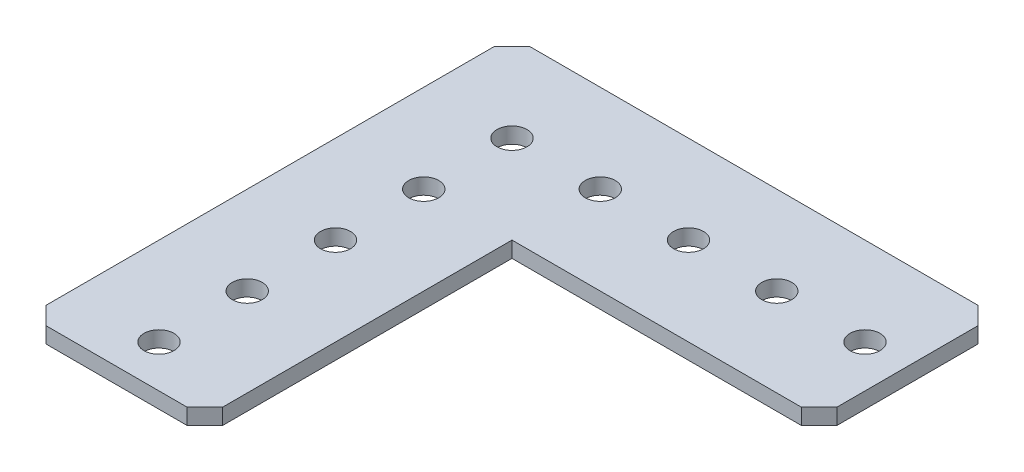
ISO-10303-21;
HEADER;
FILE_DESCRIPTION(('STEP AP214'),'2;1');
FILE_NAME('part.step','',(''),(''),'','','');
FILE_SCHEMA(('AUTOMOTIVE_DESIGN { 1 0 10303 214 1 1 1 1 }'));
ENDSEC;
DATA;
#1=APPLICATION_CONTEXT('core data for automotive mechanical design processes');
#2=APPLICATION_PROTOCOL_DEFINITION('international standard','automotive_design',2000,#1);
#3=PRODUCT_CONTEXT('',#1,'mechanical');
#4=PRODUCT('Part','Part','',(#3));
#5=PRODUCT_RELATED_PRODUCT_CATEGORY('part','',(#4));
#6=PRODUCT_DEFINITION_FORMATION('','',#4);
#7=PRODUCT_DEFINITION_CONTEXT('part definition',#1,'design');
#8=PRODUCT_DEFINITION('design','',#6,#7);
#9=PRODUCT_DEFINITION_SHAPE('','',#8);
#10=(LENGTH_UNIT() NAMED_UNIT(*) SI_UNIT(.MILLI.,.METRE.));
#11=(NAMED_UNIT(*) PLANE_ANGLE_UNIT() SI_UNIT($,.RADIAN.));
#12=(NAMED_UNIT(*) SI_UNIT($,.STERADIAN.) SOLID_ANGLE_UNIT());
#13=UNCERTAINTY_MEASURE_WITH_UNIT(LENGTH_MEASURE(1.E-05),#10,'distance_accuracy_value','');
#14=(GEOMETRIC_REPRESENTATION_CONTEXT(3) GLOBAL_UNCERTAINTY_ASSIGNED_CONTEXT((#13)) GLOBAL_UNIT_ASSIGNED_CONTEXT((#10,
#11,#12)) REPRESENTATION_CONTEXT('',''));
#15=CARTESIAN_POINT('',(0.,0.,0.));
#16=DIRECTION('',(0.,0.,1.));
#17=DIRECTION('',(1.,0.,0.));
#18=AXIS2_PLACEMENT_3D('',#15,#16,#17);
#19=CARTESIAN_POINT('',(0.,2.286,0.));
#20=DIRECTION('',(0.,-1.,0.));
#21=DIRECTION('',(0.,0.,-1.));
#22=AXIS2_PLACEMENT_3D('',#19,#20,#21);
#23=PLANE('',#22);
#24=DIRECTION('',(0.,0.,-1.));
#25=VECTOR('',#24,1.);
#26=CARTESIAN_POINT('',(25.4,2.286,-44.196));
#27=LINE('',#26,#25);
#28=CARTESIAN_POINT('',(25.4,2.286,-2.54));
#29=VERTEX_POINT('',#28);
#30=CARTESIAN_POINT('',(25.4,2.286,-44.196));
#31=VERTEX_POINT('',#30);
#32=EDGE_CURVE('E172',#29,#31,#27,.T.);
#33=ORIENTED_EDGE('',*,*,#32,.T.);
#34=DIRECTION('',(1.,0.,0.));
#35=VECTOR('',#34,1.);
#36=CARTESIAN_POINT('',(67.056,2.286,-44.196));
#37=LINE('',#36,#35);
#38=CARTESIAN_POINT('',(67.056,2.286,-44.196));
#39=VERTEX_POINT('',#38);
#40=EDGE_CURVE('E105',#31,#39,#37,.T.);
#41=ORIENTED_EDGE('',*,*,#40,.T.);
#42=DIRECTION('',(0.707106781186548,0.,-0.707106781186548));
#43=VECTOR('',#42,1.);
#44=CARTESIAN_POINT('',(69.596,2.286,-46.736));
#45=LINE('',#44,#43);
#46=CARTESIAN_POINT('',(69.596,2.286,-46.736));
#47=VERTEX_POINT('',#46);
#48=EDGE_CURVE('E196',#39,#47,#45,.T.);
#49=ORIENTED_EDGE('',*,*,#48,.T.);
#50=DIRECTION('',(0.,0.,-1.));
#51=VECTOR('',#50,1.);
#52=CARTESIAN_POINT('',(69.596,2.286,-67.056));
#53=LINE('',#52,#51);
#54=CARTESIAN_POINT('',(69.596,2.286,-67.056));
#55=VERTEX_POINT('',#54);
#56=EDGE_CURVE('E215',#47,#55,#53,.T.);
#57=ORIENTED_EDGE('',*,*,#56,.T.);
#58=DIRECTION('',(-0.707106781186548,0.,-0.707106781186548));
#59=VECTOR('',#58,1.);
#60=CARTESIAN_POINT('',(67.056,2.286,-69.596));
#61=LINE('',#60,#59);
#62=CARTESIAN_POINT('',(67.056,2.286,-69.596));
#63=VERTEX_POINT('',#62);
#64=EDGE_CURVE('E212',#55,#63,#61,.T.);
#65=ORIENTED_EDGE('',*,*,#64,.T.);
#66=DIRECTION('',(-1.,0.,0.));
#67=VECTOR('',#66,1.);
#68=CARTESIAN_POINT('',(2.54,2.286,-69.596));
#69=LINE('',#68,#67);
#70=CARTESIAN_POINT('',(2.54,2.286,-69.596));
#71=VERTEX_POINT('',#70);
#72=EDGE_CURVE('E214',#63,#71,#69,.T.);
#73=ORIENTED_EDGE('',*,*,#72,.T.);
#74=DIRECTION('',(-0.707106781186547,0.,0.707106781186548));
#75=VECTOR('',#74,1.);
#76=CARTESIAN_POINT('',(0.,2.286,-67.056));
#77=LINE('',#76,#75);
#78=CARTESIAN_POINT('',(0.,2.286,-67.056));
#79=VERTEX_POINT('',#78);
#80=EDGE_CURVE('E217',#71,#79,#77,.T.);
#81=ORIENTED_EDGE('',*,*,#80,.T.);
#82=DIRECTION('',(0.,0.,1.));
#83=VECTOR('',#82,1.);
#84=CARTESIAN_POINT('',(0.,2.286,-2.54));
#85=LINE('',#84,#83);
#86=CARTESIAN_POINT('',(0.,2.286,-2.54));
#87=VERTEX_POINT('',#86);
#88=EDGE_CURVE('E133',#79,#87,#85,.T.);
#89=ORIENTED_EDGE('',*,*,#88,.T.);
#90=DIRECTION('',(0.707106781186548,0.,0.707106781186548));
#91=VECTOR('',#90,1.);
#92=CARTESIAN_POINT('',(2.54,2.286,0.));
#93=LINE('',#92,#91);
#94=CARTESIAN_POINT('',(2.54,2.286,0.));
#95=VERTEX_POINT('',#94);
#96=EDGE_CURVE('E127',#87,#95,#93,.T.);
#97=ORIENTED_EDGE('',*,*,#96,.T.);
#98=DIRECTION('',(1.,0.,0.));
#99=VECTOR('',#98,1.);
#100=CARTESIAN_POINT('',(22.86,2.286,0.));
#101=LINE('',#100,#99);
#102=CARTESIAN_POINT('',(22.86,2.286,0.));
#103=VERTEX_POINT('',#102);
#104=EDGE_CURVE('E131',#95,#103,#101,.T.);
#105=ORIENTED_EDGE('',*,*,#104,.T.);
#106=DIRECTION('',(0.707106781186548,0.,-0.707106781186547));
#107=VECTOR('',#106,1.);
#108=CARTESIAN_POINT('',(25.4,2.286,-2.54));
#109=LINE('',#108,#107);
#110=EDGE_CURVE('E53',#103,#29,#109,.T.);
#111=ORIENTED_EDGE('',*,*,#110,.T.);
#112=EDGE_LOOP('',(#33,#41,#49,#57,#65,#73,#81,#89,#97,#105,#111));
#113=FACE_BOUND('',#112,.T.);
#114=CARTESIAN_POINT('',(12.7,2.286,-56.896));
#115=DIRECTION('',(0.,1.,0.));
#116=DIRECTION('',(0.,0.,1.));
#117=AXIS2_PLACEMENT_3D('',#114,#115,#116);
#118=CIRCLE('',#117,2.159);
#119=CARTESIAN_POINT('',(12.7,2.286,-54.737));
#120=VERTEX_POINT('',#119);
#121=EDGE_CURVE('E155',#120,#120,#118,.T.);
#122=ORIENTED_EDGE('',*,*,#121,.F.);
#123=EDGE_LOOP('',(#122));
#124=FACE_BOUND('',#123,.T.);
#125=CARTESIAN_POINT('',(25.4,2.286,-56.896));
#126=DIRECTION('',(0.,1.,0.));
#127=DIRECTION('',(0.,0.,1.));
#128=AXIS2_PLACEMENT_3D('',#125,#126,#127);
#129=CIRCLE('',#128,2.159);
#130=CARTESIAN_POINT('',(25.4,2.286,-54.737));
#131=VERTEX_POINT('',#130);
#132=EDGE_CURVE('E334',#131,#131,#129,.T.);
#133=ORIENTED_EDGE('',*,*,#132,.F.);
#134=EDGE_LOOP('',(#133));
#135=FACE_BOUND('',#134,.T.);
#136=CARTESIAN_POINT('',(38.1,2.286,-56.896));
#137=DIRECTION('',(0.,1.,0.));
#138=DIRECTION('',(0.,0.,1.));
#139=AXIS2_PLACEMENT_3D('',#136,#137,#138);
#140=CIRCLE('',#139,2.15900000000001);
#141=CARTESIAN_POINT('',(38.1,2.286,-54.737));
#142=VERTEX_POINT('',#141);
#143=EDGE_CURVE('E328',#142,#142,#140,.T.);
#144=ORIENTED_EDGE('',*,*,#143,.F.);
#145=EDGE_LOOP('',(#144));
#146=FACE_BOUND('',#145,.T.);
#147=CARTESIAN_POINT('',(50.8,2.286,-56.896));
#148=DIRECTION('',(0.,1.,0.));
#149=DIRECTION('',(0.,0.,1.));
#150=AXIS2_PLACEMENT_3D('',#147,#148,#149);
#151=CIRCLE('',#150,2.15899999999999);
#152=CARTESIAN_POINT('',(50.8,2.286,-54.737));
#153=VERTEX_POINT('',#152);
#154=EDGE_CURVE('E322',#153,#153,#151,.T.);
#155=ORIENTED_EDGE('',*,*,#154,.F.);
#156=EDGE_LOOP('',(#155));
#157=FACE_BOUND('',#156,.T.);
#158=CARTESIAN_POINT('',(63.5,2.286,-56.896));
#159=DIRECTION('',(0.,1.,0.));
#160=DIRECTION('',(0.,0.,1.));
#161=AXIS2_PLACEMENT_3D('',#158,#159,#160);
#162=CIRCLE('',#161,2.15899999999999);
#163=CARTESIAN_POINT('',(63.5,2.286,-54.737));
#164=VERTEX_POINT('',#163);
#165=EDGE_CURVE('E316',#164,#164,#162,.T.);
#166=ORIENTED_EDGE('',*,*,#165,.F.);
#167=EDGE_LOOP('',(#166));
#168=FACE_BOUND('',#167,.T.);
#169=CARTESIAN_POINT('',(12.7000000000001,2.286,-44.196));
#170=DIRECTION('',(0.,1.,0.));
#171=DIRECTION('',(0.,0.,1.));
#172=AXIS2_PLACEMENT_3D('',#169,#170,#171);
#173=CIRCLE('',#172,2.159);
#174=CARTESIAN_POINT('',(12.7000000000001,2.286,-42.037));
#175=VERTEX_POINT('',#174);
#176=EDGE_CURVE('E310',#175,#175,#173,.T.);
#177=ORIENTED_EDGE('',*,*,#176,.F.);
#178=EDGE_LOOP('',(#177));
#179=FACE_BOUND('',#178,.T.);
#180=CARTESIAN_POINT('',(12.7000000000003,2.286,-31.496));
#181=DIRECTION('',(0.,1.,0.));
#182=DIRECTION('',(0.,0.,1.));
#183=AXIS2_PLACEMENT_3D('',#180,#181,#182);
#184=CIRCLE('',#183,2.159);
#185=CARTESIAN_POINT('',(12.7000000000003,2.286,-29.337));
#186=VERTEX_POINT('',#185);
#187=EDGE_CURVE('E304',#186,#186,#184,.T.);
#188=ORIENTED_EDGE('',*,*,#187,.F.);
#189=EDGE_LOOP('',(#188));
#190=FACE_BOUND('',#189,.T.);
#191=CARTESIAN_POINT('',(12.7000000000004,2.286,-18.796));
#192=DIRECTION('',(0.,1.,0.));
#193=DIRECTION('',(0.,0.,1.));
#194=AXIS2_PLACEMENT_3D('',#191,#192,#193);
#195=CIRCLE('',#194,2.159);
#196=CARTESIAN_POINT('',(12.7000000000004,2.286,-16.637));
#197=VERTEX_POINT('',#196);
#198=EDGE_CURVE('E298',#197,#197,#195,.T.);
#199=ORIENTED_EDGE('',*,*,#198,.F.);
#200=EDGE_LOOP('',(#199));
#201=FACE_BOUND('',#200,.T.);
#202=CARTESIAN_POINT('',(12.7000000000005,2.286,-6.096));
#203=DIRECTION('',(0.,1.,0.));
#204=DIRECTION('',(0.,0.,1.));
#205=AXIS2_PLACEMENT_3D('',#202,#203,#204);
#206=CIRCLE('',#205,2.159);
#207=CARTESIAN_POINT('',(12.7000000000005,2.286,-3.937));
#208=VERTEX_POINT('',#207);
#209=EDGE_CURVE('E289',#208,#208,#206,.T.);
#210=ORIENTED_EDGE('',*,*,#209,.F.);
#211=EDGE_LOOP('',(#210));
#212=FACE_BOUND('',#211,.T.);
#213=ADVANCED_FACE('F36',(#113,#124,#135,#146,#157,#168,#179,#190,#201,#212),#23,.F.);
#214=CARTESIAN_POINT('',(0.,0.,0.));
#215=DIRECTION('',(0.,-1.,0.));
#216=DIRECTION('',(0.,0.,-1.));
#217=AXIS2_PLACEMENT_3D('',#214,#215,#216);
#218=PLANE('',#217);
#219=CARTESIAN_POINT('',(12.7000000000004,0.,-18.796));
#220=DIRECTION('',(0.,1.,0.));
#221=DIRECTION('',(0.,0.,1.));
#222=AXIS2_PLACEMENT_3D('',#219,#220,#221);
#223=CIRCLE('',#222,2.159);
#224=CARTESIAN_POINT('',(12.7000000000004,0.,-16.637));
#225=VERTEX_POINT('',#224);
#226=EDGE_CURVE('E295',#225,#225,#223,.T.);
#227=ORIENTED_EDGE('',*,*,#226,.T.);
#228=EDGE_LOOP('',(#227));
#229=FACE_BOUND('',#228,.T.);
#230=CARTESIAN_POINT('',(12.7000000000001,0.,-44.196));
#231=DIRECTION('',(0.,1.,0.));
#232=DIRECTION('',(0.,0.,1.));
#233=AXIS2_PLACEMENT_3D('',#230,#231,#232);
#234=CIRCLE('',#233,2.159);
#235=CARTESIAN_POINT('',(12.7000000000001,0.,-42.037));
#236=VERTEX_POINT('',#235);
#237=EDGE_CURVE('E307',#236,#236,#234,.T.);
#238=ORIENTED_EDGE('',*,*,#237,.T.);
#239=EDGE_LOOP('',(#238));
#240=FACE_BOUND('',#239,.T.);
#241=CARTESIAN_POINT('',(50.8,0.,-56.896));
#242=DIRECTION('',(0.,1.,0.));
#243=DIRECTION('',(0.,0.,1.));
#244=AXIS2_PLACEMENT_3D('',#241,#242,#243);
#245=CIRCLE('',#244,2.15899999999999);
#246=CARTESIAN_POINT('',(50.8,0.,-54.737));
#247=VERTEX_POINT('',#246);
#248=EDGE_CURVE('E319',#247,#247,#245,.T.);
#249=ORIENTED_EDGE('',*,*,#248,.T.);
#250=EDGE_LOOP('',(#249));
#251=FACE_BOUND('',#250,.T.);
#252=CARTESIAN_POINT('',(25.4,0.,-56.896));
#253=DIRECTION('',(0.,1.,0.));
#254=DIRECTION('',(0.,0.,1.));
#255=AXIS2_PLACEMENT_3D('',#252,#253,#254);
#256=CIRCLE('',#255,2.159);
#257=CARTESIAN_POINT('',(25.4,0.,-54.737));
#258=VERTEX_POINT('',#257);
#259=EDGE_CURVE('E331',#258,#258,#256,.T.);
#260=ORIENTED_EDGE('',*,*,#259,.T.);
#261=EDGE_LOOP('',(#260));
#262=FACE_BOUND('',#261,.T.);
#263=DIRECTION('',(0.,0.,-1.));
#264=VECTOR('',#263,1.);
#265=CARTESIAN_POINT('',(25.4,0.,-44.196));
#266=LINE('',#265,#264);
#267=CARTESIAN_POINT('',(25.4,0.,-2.54));
#268=VERTEX_POINT('',#267);
#269=CARTESIAN_POINT('',(25.4,0.,-44.196));
#270=VERTEX_POINT('',#269);
#271=EDGE_CURVE('E151',#268,#270,#266,.T.);
#272=ORIENTED_EDGE('',*,*,#271,.F.);
#273=DIRECTION('',(0.707106781186548,0.,-0.707106781186547));
#274=VECTOR('',#273,1.);
#275=CARTESIAN_POINT('',(25.4,0.,-2.54));
#276=LINE('',#275,#274);
#277=CARTESIAN_POINT('',(22.86,0.,0.));
#278=VERTEX_POINT('',#277);
#279=EDGE_CURVE('E97',#278,#268,#276,.T.);
#280=ORIENTED_EDGE('',*,*,#279,.F.);
#281=DIRECTION('',(1.,0.,0.));
#282=VECTOR('',#281,1.);
#283=CARTESIAN_POINT('',(22.86,0.,0.));
#284=LINE('',#283,#282);
#285=CARTESIAN_POINT('',(2.54,0.,0.));
#286=VERTEX_POINT('',#285);
#287=EDGE_CURVE('E91',#286,#278,#284,.T.);
#288=ORIENTED_EDGE('',*,*,#287,.F.);
#289=DIRECTION('',(0.707106781186548,0.,0.707106781186548));
#290=VECTOR('',#289,1.);
#291=CARTESIAN_POINT('',(2.54,0.,0.));
#292=LINE('',#291,#290);
#293=CARTESIAN_POINT('',(0.,0.,-2.54));
#294=VERTEX_POINT('',#293);
#295=EDGE_CURVE('E141',#294,#286,#292,.T.);
#296=ORIENTED_EDGE('',*,*,#295,.F.);
#297=DIRECTION('',(0.,0.,1.));
#298=VECTOR('',#297,1.);
#299=CARTESIAN_POINT('',(0.,0.,-2.54));
#300=LINE('',#299,#298);
#301=CARTESIAN_POINT('',(0.,0.,-67.056));
#302=VERTEX_POINT('',#301);
#303=EDGE_CURVE('E167',#302,#294,#300,.T.);
#304=ORIENTED_EDGE('',*,*,#303,.F.);
#305=DIRECTION('',(-0.707106781186547,0.,0.707106781186548));
#306=VECTOR('',#305,1.);
#307=CARTESIAN_POINT('',(0.,0.,-67.056));
#308=LINE('',#307,#306);
#309=CARTESIAN_POINT('',(2.54,0.,-69.596));
#310=VERTEX_POINT('',#309);
#311=EDGE_CURVE('E165',#310,#302,#308,.T.);
#312=ORIENTED_EDGE('',*,*,#311,.F.);
#313=DIRECTION('',(-1.,0.,0.));
#314=VECTOR('',#313,1.);
#315=CARTESIAN_POINT('',(2.54,0.,-69.596));
#316=LINE('',#315,#314);
#317=CARTESIAN_POINT('',(67.056,0.,-69.596));
#318=VERTEX_POINT('',#317);
#319=EDGE_CURVE('E163',#318,#310,#316,.T.);
#320=ORIENTED_EDGE('',*,*,#319,.F.);
#321=DIRECTION('',(-0.707106781186548,0.,-0.707106781186548));
#322=VECTOR('',#321,1.);
#323=CARTESIAN_POINT('',(67.056,0.,-69.596));
#324=LINE('',#323,#322);
#325=CARTESIAN_POINT('',(69.596,0.,-67.056));
#326=VERTEX_POINT('',#325);
#327=EDGE_CURVE('E161',#326,#318,#324,.T.);
#328=ORIENTED_EDGE('',*,*,#327,.F.);
#329=DIRECTION('',(0.,0.,-1.));
#330=VECTOR('',#329,1.);
#331=CARTESIAN_POINT('',(69.596,0.,-67.056));
#332=LINE('',#331,#330);
#333=CARTESIAN_POINT('',(69.596,0.,-46.736));
#334=VERTEX_POINT('',#333);
#335=EDGE_CURVE('E159',#334,#326,#332,.T.);
#336=ORIENTED_EDGE('',*,*,#335,.F.);
#337=DIRECTION('',(0.707106781186548,0.,-0.707106781186548));
#338=VECTOR('',#337,1.);
#339=CARTESIAN_POINT('',(69.596,0.,-46.736));
#340=LINE('',#339,#338);
#341=CARTESIAN_POINT('',(67.056,0.,-44.196));
#342=VERTEX_POINT('',#341);
#343=EDGE_CURVE('E157',#342,#334,#340,.T.);
#344=ORIENTED_EDGE('',*,*,#343,.F.);
#345=DIRECTION('',(1.,0.,0.));
#346=VECTOR('',#345,1.);
#347=CARTESIAN_POINT('',(67.056,0.,-44.196));
#348=LINE('',#347,#346);
#349=EDGE_CURVE('E154',#270,#342,#348,.T.);
#350=ORIENTED_EDGE('',*,*,#349,.F.);
#351=EDGE_LOOP('',(#272,#280,#288,#296,#304,#312,#320,#328,#336,#344,#350));
#352=FACE_BOUND('',#351,.T.);
#353=CARTESIAN_POINT('',(12.7,0.,-56.896));
#354=DIRECTION('',(0.,1.,0.));
#355=DIRECTION('',(0.,0.,1.));
#356=AXIS2_PLACEMENT_3D('',#353,#354,#355);
#357=CIRCLE('',#356,2.159);
#358=CARTESIAN_POINT('',(12.7,0.,-54.737));
#359=VERTEX_POINT('',#358);
#360=EDGE_CURVE('E337',#359,#359,#357,.T.);
#361=ORIENTED_EDGE('',*,*,#360,.T.);
#362=EDGE_LOOP('',(#361));
#363=FACE_BOUND('',#362,.T.);
#364=CARTESIAN_POINT('',(38.1,0.,-56.896));
#365=DIRECTION('',(0.,1.,0.));
#366=DIRECTION('',(0.,0.,1.));
#367=AXIS2_PLACEMENT_3D('',#364,#365,#366);
#368=CIRCLE('',#367,2.15900000000001);
#369=CARTESIAN_POINT('',(38.1,0.,-54.737));
#370=VERTEX_POINT('',#369);
#371=EDGE_CURVE('E325',#370,#370,#368,.T.);
#372=ORIENTED_EDGE('',*,*,#371,.T.);
#373=EDGE_LOOP('',(#372));
#374=FACE_BOUND('',#373,.T.);
#375=CARTESIAN_POINT('',(63.5,0.,-56.896));
#376=DIRECTION('',(0.,1.,0.));
#377=DIRECTION('',(0.,0.,1.));
#378=AXIS2_PLACEMENT_3D('',#375,#376,#377);
#379=CIRCLE('',#378,2.15899999999999);
#380=CARTESIAN_POINT('',(63.5,0.,-54.737));
#381=VERTEX_POINT('',#380);
#382=EDGE_CURVE('E313',#381,#381,#379,.T.);
#383=ORIENTED_EDGE('',*,*,#382,.T.);
#384=EDGE_LOOP('',(#383));
#385=FACE_BOUND('',#384,.T.);
#386=CARTESIAN_POINT('',(12.7000000000003,0.,-31.496));
#387=DIRECTION('',(0.,1.,0.));
#388=DIRECTION('',(0.,0.,1.));
#389=AXIS2_PLACEMENT_3D('',#386,#387,#388);
#390=CIRCLE('',#389,2.159);
#391=CARTESIAN_POINT('',(12.7000000000003,0.,-29.337));
#392=VERTEX_POINT('',#391);
#393=EDGE_CURVE('E301',#392,#392,#390,.T.);
#394=ORIENTED_EDGE('',*,*,#393,.T.);
#395=EDGE_LOOP('',(#394));
#396=FACE_BOUND('',#395,.T.);
#397=CARTESIAN_POINT('',(12.7000000000005,0.,-6.096));
#398=DIRECTION('',(0.,1.,0.));
#399=DIRECTION('',(0.,0.,1.));
#400=AXIS2_PLACEMENT_3D('',#397,#398,#399);
#401=CIRCLE('',#400,2.159);
#402=CARTESIAN_POINT('',(12.7000000000005,0.,-3.937));
#403=VERTEX_POINT('',#402);
#404=EDGE_CURVE('E292',#403,#403,#401,.T.);
#405=ORIENTED_EDGE('',*,*,#404,.T.);
#406=EDGE_LOOP('',(#405));
#407=FACE_BOUND('',#406,.T.);
#408=ADVANCED_FACE('F200',(#229,#240,#251,#262,#352,#363,#374,#385,#396,#407),#218,.T.);
#409=CARTESIAN_POINT('',(25.4,2.286,-44.196));
#410=DIRECTION('',(-1.,0.,0.));
#411=DIRECTION('',(0.,0.,1.));
#412=AXIS2_PLACEMENT_3D('',#409,#410,#411);
#413=PLANE('',#412);
#414=ORIENTED_EDGE('',*,*,#271,.T.);
#415=DIRECTION('',(0.,-1.,0.));
#416=VECTOR('',#415,1.);
#417=CARTESIAN_POINT('',(25.4,2.286,-44.196));
#418=LINE('',#417,#416);
#419=EDGE_CURVE('E11',#31,#270,#418,.T.);
#420=ORIENTED_EDGE('',*,*,#419,.F.);
#421=ORIENTED_EDGE('',*,*,#32,.F.);
#422=DIRECTION('',(0.,-1.,0.));
#423=VECTOR('',#422,1.);
#424=CARTESIAN_POINT('',(25.4,2.286,-2.54));
#425=LINE('',#424,#423);
#426=EDGE_CURVE('E147',#29,#268,#425,.T.);
#427=ORIENTED_EDGE('',*,*,#426,.T.);
#428=EDGE_LOOP('',(#414,#420,#421,#427));
#429=FACE_BOUND('',#428,.T.);
#430=ADVANCED_FACE('F38',(#429),#413,.F.);
#431=CARTESIAN_POINT('',(67.056,2.286,-44.196));
#432=DIRECTION('',(0.,0.,-1.));
#433=DIRECTION('',(-1.,0.,0.));
#434=AXIS2_PLACEMENT_3D('',#431,#432,#433);
#435=PLANE('',#434);
#436=ORIENTED_EDGE('',*,*,#349,.T.);
#437=DIRECTION('',(0.,-1.,0.));
#438=VECTOR('',#437,1.);
#439=CARTESIAN_POINT('',(67.056,2.286,-44.196));
#440=LINE('',#439,#438);
#441=EDGE_CURVE('E45',#39,#342,#440,.T.);
#442=ORIENTED_EDGE('',*,*,#441,.F.);
#443=ORIENTED_EDGE('',*,*,#40,.F.);
#444=ORIENTED_EDGE('',*,*,#419,.T.);
#445=EDGE_LOOP('',(#436,#442,#443,#444));
#446=FACE_BOUND('',#445,.T.);
#447=ADVANCED_FACE('F484',(#446),#435,.F.);
#448=CARTESIAN_POINT('',(69.596,2.286,-46.736));
#449=DIRECTION('',(-0.707106781186548,0.,-0.707106781186548));
#450=DIRECTION('',(-0.707106781186548,0.,0.707106781186548));
#451=AXIS2_PLACEMENT_3D('',#448,#449,#450);
#452=PLANE('',#451);
#453=ORIENTED_EDGE('',*,*,#343,.T.);
#454=DIRECTION('',(0.,-1.,0.));
#455=VECTOR('',#454,1.);
#456=CARTESIAN_POINT('',(69.596,2.286,-46.736));
#457=LINE('',#456,#455);
#458=EDGE_CURVE('E188',#47,#334,#457,.T.);
#459=ORIENTED_EDGE('',*,*,#458,.F.);
#460=ORIENTED_EDGE('',*,*,#48,.F.);
#461=ORIENTED_EDGE('',*,*,#441,.T.);
#462=EDGE_LOOP('',(#453,#459,#460,#461));
#463=FACE_BOUND('',#462,.T.);
#464=ADVANCED_FACE('F194',(#463),#452,.F.);
#465=CARTESIAN_POINT('',(69.596,2.286,-67.056));
#466=DIRECTION('',(-1.,0.,0.));
#467=DIRECTION('',(0.,0.,1.));
#468=AXIS2_PLACEMENT_3D('',#465,#466,#467);
#469=PLANE('',#468);
#470=ORIENTED_EDGE('',*,*,#335,.T.);
#471=DIRECTION('',(0.,-1.,0.));
#472=VECTOR('',#471,1.);
#473=CARTESIAN_POINT('',(69.596,2.286,-67.056));
#474=LINE('',#473,#472);
#475=EDGE_CURVE('E185',#55,#326,#474,.T.);
#476=ORIENTED_EDGE('',*,*,#475,.F.);
#477=ORIENTED_EDGE('',*,*,#56,.F.);
#478=ORIENTED_EDGE('',*,*,#458,.T.);
#479=EDGE_LOOP('',(#470,#476,#477,#478));
#480=FACE_BOUND('',#479,.T.);
#481=ADVANCED_FACE('F206',(#480),#469,.F.);
#482=CARTESIAN_POINT('',(67.056,2.286,-69.596));
#483=DIRECTION('',(-0.707106781186548,0.,0.707106781186548));
#484=DIRECTION('',(0.707106781186548,0.,0.707106781186548));
#485=AXIS2_PLACEMENT_3D('',#482,#483,#484);
#486=PLANE('',#485);
#487=ORIENTED_EDGE('',*,*,#327,.T.);
#488=DIRECTION('',(0.,-1.,0.));
#489=VECTOR('',#488,1.);
#490=CARTESIAN_POINT('',(67.056,2.286,-69.596));
#491=LINE('',#490,#489);
#492=EDGE_CURVE('E182',#63,#318,#491,.T.);
#493=ORIENTED_EDGE('',*,*,#492,.F.);
#494=ORIENTED_EDGE('',*,*,#64,.F.);
#495=ORIENTED_EDGE('',*,*,#475,.T.);
#496=EDGE_LOOP('',(#487,#493,#494,#495));
#497=FACE_BOUND('',#496,.T.);
#498=ADVANCED_FACE('F210',(#497),#486,.F.);
#499=CARTESIAN_POINT('',(2.54,2.286,-69.596));
#500=DIRECTION('',(0.,0.,1.));
#501=DIRECTION('',(1.,0.,0.));
#502=AXIS2_PLACEMENT_3D('',#499,#500,#501);
#503=PLANE('',#502);
#504=ORIENTED_EDGE('',*,*,#319,.T.);
#505=DIRECTION('',(0.,-1.,0.));
#506=VECTOR('',#505,1.);
#507=CARTESIAN_POINT('',(2.54,2.286,-69.596));
#508=LINE('',#507,#506);
#509=EDGE_CURVE('E179',#71,#310,#508,.T.);
#510=ORIENTED_EDGE('',*,*,#509,.F.);
#511=ORIENTED_EDGE('',*,*,#72,.F.);
#512=ORIENTED_EDGE('',*,*,#492,.T.);
#513=EDGE_LOOP('',(#504,#510,#511,#512));
#514=FACE_BOUND('',#513,.T.);
#515=ADVANCED_FACE('F450',(#514),#503,.F.);
#516=CARTESIAN_POINT('',(0.,2.286,-67.056));
#517=DIRECTION('',(0.707106781186548,0.,0.707106781186547));
#518=DIRECTION('',(0.707106781186547,0.,-0.707106781186548));
#519=AXIS2_PLACEMENT_3D('',#516,#517,#518);
#520=PLANE('',#519);
#521=ORIENTED_EDGE('',*,*,#311,.T.);
#522=DIRECTION('',(0.,-1.,0.));
#523=VECTOR('',#522,1.);
#524=CARTESIAN_POINT('',(0.,2.286,-67.056));
#525=LINE('',#524,#523);
#526=EDGE_CURVE('E176',#79,#302,#525,.T.);
#527=ORIENTED_EDGE('',*,*,#526,.F.);
#528=ORIENTED_EDGE('',*,*,#80,.F.);
#529=ORIENTED_EDGE('',*,*,#509,.T.);
#530=EDGE_LOOP('',(#521,#527,#528,#529));
#531=FACE_BOUND('',#530,.T.);
#532=ADVANCED_FACE('F226',(#531),#520,.F.);
#533=CARTESIAN_POINT('',(0.,2.286,-2.54));
#534=DIRECTION('',(1.,0.,0.));
#535=DIRECTION('',(0.,0.,-1.));
#536=AXIS2_PLACEMENT_3D('',#533,#534,#535);
#537=PLANE('',#536);
#538=ORIENTED_EDGE('',*,*,#303,.T.);
#539=DIRECTION('',(0.,-1.,0.));
#540=VECTOR('',#539,1.);
#541=CARTESIAN_POINT('',(0.,2.286,-2.54));
#542=LINE('',#541,#540);
#543=EDGE_CURVE('E142',#87,#294,#542,.T.);
#544=ORIENTED_EDGE('',*,*,#543,.F.);
#545=ORIENTED_EDGE('',*,*,#88,.F.);
#546=ORIENTED_EDGE('',*,*,#526,.T.);
#547=EDGE_LOOP('',(#538,#544,#545,#546));
#548=FACE_BOUND('',#547,.T.);
#549=ADVANCED_FACE('F230',(#548),#537,.F.);
#550=CARTESIAN_POINT('',(2.54,2.286,0.));
#551=DIRECTION('',(0.707106781186548,0.,-0.707106781186548));
#552=DIRECTION('',(-0.707106781186548,0.,-0.707106781186548));
#553=AXIS2_PLACEMENT_3D('',#550,#551,#552);
#554=PLANE('',#553);
#555=ORIENTED_EDGE('',*,*,#295,.T.);
#556=DIRECTION('',(0.,-1.,0.));
#557=VECTOR('',#556,1.);
#558=CARTESIAN_POINT('',(2.54,2.286,0.));
#559=LINE('',#558,#557);
#560=EDGE_CURVE('E138',#95,#286,#559,.T.);
#561=ORIENTED_EDGE('',*,*,#560,.F.);
#562=ORIENTED_EDGE('',*,*,#96,.F.);
#563=ORIENTED_EDGE('',*,*,#543,.T.);
#564=EDGE_LOOP('',(#555,#561,#562,#563));
#565=FACE_BOUND('',#564,.T.);
#566=ADVANCED_FACE('F139',(#565),#554,.F.);
#567=CARTESIAN_POINT('',(22.86,2.286,0.));
#568=DIRECTION('',(0.,0.,-1.));
#569=DIRECTION('',(-1.,0.,0.));
#570=AXIS2_PLACEMENT_3D('',#567,#568,#569);
#571=PLANE('',#570);
#572=ORIENTED_EDGE('',*,*,#287,.T.);
#573=DIRECTION('',(0.,-1.,0.));
#574=VECTOR('',#573,1.);
#575=CARTESIAN_POINT('',(22.86,2.286,0.));
#576=LINE('',#575,#574);
#577=EDGE_CURVE('E143',#103,#278,#576,.T.);
#578=ORIENTED_EDGE('',*,*,#577,.F.);
#579=ORIENTED_EDGE('',*,*,#104,.F.);
#580=ORIENTED_EDGE('',*,*,#560,.T.);
#581=EDGE_LOOP('',(#572,#578,#579,#580));
#582=FACE_BOUND('',#581,.T.);
#583=ADVANCED_FACE('F145',(#582),#571,.F.);
#584=CARTESIAN_POINT('',(25.4,2.286,-2.54));
#585=DIRECTION('',(-0.707106781186547,0.,-0.707106781186548));
#586=DIRECTION('',(-0.707106781186548,0.,0.707106781186547));
#587=AXIS2_PLACEMENT_3D('',#584,#585,#586);
#588=PLANE('',#587);
#589=ORIENTED_EDGE('',*,*,#279,.T.);
#590=ORIENTED_EDGE('',*,*,#426,.F.);
#591=ORIENTED_EDGE('',*,*,#110,.F.);
#592=ORIENTED_EDGE('',*,*,#577,.T.);
#593=EDGE_LOOP('',(#589,#590,#591,#592));
#594=FACE_BOUND('',#593,.T.);
#595=ADVANCED_FACE('F234',(#594),#588,.F.);
#596=CARTESIAN_POINT('',(12.7,2.286,-56.896));
#597=DIRECTION('',(0.,-1.,0.));
#598=DIRECTION('',(0.,0.,-1.));
#599=AXIS2_PLACEMENT_3D('',#596,#597,#598);
#600=CYLINDRICAL_SURFACE('',#599,2.159);
#601=ORIENTED_EDGE('',*,*,#121,.T.);
#602=EDGE_LOOP('',(#601));
#603=FACE_BOUND('',#602,.T.);
#604=ORIENTED_EDGE('',*,*,#360,.F.);
#605=EDGE_LOOP('',(#604));
#606=FACE_BOUND('',#605,.T.);
#607=ADVANCED_FACE('F236',(#603,#606),#600,.F.);
#608=CARTESIAN_POINT('',(25.4,2.286,-56.896));
#609=DIRECTION('',(0.,-1.,0.));
#610=DIRECTION('',(0.,0.,-1.));
#611=AXIS2_PLACEMENT_3D('',#608,#609,#610);
#612=CYLINDRICAL_SURFACE('',#611,2.159);
#613=ORIENTED_EDGE('',*,*,#132,.T.);
#614=EDGE_LOOP('',(#613));
#615=FACE_BOUND('',#614,.T.);
#616=ORIENTED_EDGE('',*,*,#259,.F.);
#617=EDGE_LOOP('',(#616));
#618=FACE_BOUND('',#617,.T.);
#619=ADVANCED_FACE('F242',(#615,#618),#612,.F.);
#620=CARTESIAN_POINT('',(38.1,2.286,-56.896));
#621=DIRECTION('',(0.,-1.,0.));
#622=DIRECTION('',(0.,0.,-1.));
#623=AXIS2_PLACEMENT_3D('',#620,#621,#622);
#624=CYLINDRICAL_SURFACE('',#623,2.15900000000001);
#625=ORIENTED_EDGE('',*,*,#143,.T.);
#626=EDGE_LOOP('',(#625));
#627=FACE_BOUND('',#626,.T.);
#628=ORIENTED_EDGE('',*,*,#371,.F.);
#629=EDGE_LOOP('',(#628));
#630=FACE_BOUND('',#629,.T.);
#631=ADVANCED_FACE('F256',(#627,#630),#624,.F.);
#632=CARTESIAN_POINT('',(50.8,2.286,-56.896));
#633=DIRECTION('',(0.,-1.,0.));
#634=DIRECTION('',(0.,0.,-1.));
#635=AXIS2_PLACEMENT_3D('',#632,#633,#634);
#636=CYLINDRICAL_SURFACE('',#635,2.15899999999999);
#637=ORIENTED_EDGE('',*,*,#154,.T.);
#638=EDGE_LOOP('',(#637));
#639=FACE_BOUND('',#638,.T.);
#640=ORIENTED_EDGE('',*,*,#248,.F.);
#641=EDGE_LOOP('',(#640));
#642=FACE_BOUND('',#641,.T.);
#643=ADVANCED_FACE('F260',(#639,#642),#636,.F.);
#644=CARTESIAN_POINT('',(63.5,2.286,-56.896));
#645=DIRECTION('',(0.,-1.,0.));
#646=DIRECTION('',(0.,0.,-1.));
#647=AXIS2_PLACEMENT_3D('',#644,#645,#646);
#648=CYLINDRICAL_SURFACE('',#647,2.15899999999999);
#649=ORIENTED_EDGE('',*,*,#165,.T.);
#650=EDGE_LOOP('',(#649));
#651=FACE_BOUND('',#650,.T.);
#652=ORIENTED_EDGE('',*,*,#382,.F.);
#653=EDGE_LOOP('',(#652));
#654=FACE_BOUND('',#653,.T.);
#655=ADVANCED_FACE('F264',(#651,#654),#648,.F.);
#656=CARTESIAN_POINT('',(12.7000000000001,2.286,-44.196));
#657=DIRECTION('',(0.,-1.,0.));
#658=DIRECTION('',(0.,0.,-1.));
#659=AXIS2_PLACEMENT_3D('',#656,#657,#658);
#660=CYLINDRICAL_SURFACE('',#659,2.159);
#661=ORIENTED_EDGE('',*,*,#176,.T.);
#662=EDGE_LOOP('',(#661));
#663=FACE_BOUND('',#662,.T.);
#664=ORIENTED_EDGE('',*,*,#237,.F.);
#665=EDGE_LOOP('',(#664));
#666=FACE_BOUND('',#665,.T.);
#667=ADVANCED_FACE('F268',(#663,#666),#660,.F.);
#668=CARTESIAN_POINT('',(12.7000000000003,2.286,-31.496));
#669=DIRECTION('',(0.,-1.,0.));
#670=DIRECTION('',(0.,0.,-1.));
#671=AXIS2_PLACEMENT_3D('',#668,#669,#670);
#672=CYLINDRICAL_SURFACE('',#671,2.159);
#673=ORIENTED_EDGE('',*,*,#187,.T.);
#674=EDGE_LOOP('',(#673));
#675=FACE_BOUND('',#674,.T.);
#676=ORIENTED_EDGE('',*,*,#393,.F.);
#677=EDGE_LOOP('',(#676));
#678=FACE_BOUND('',#677,.T.);
#679=ADVANCED_FACE('F272',(#675,#678),#672,.F.);
#680=CARTESIAN_POINT('',(12.7000000000004,2.286,-18.796));
#681=DIRECTION('',(0.,-1.,0.));
#682=DIRECTION('',(0.,0.,-1.));
#683=AXIS2_PLACEMENT_3D('',#680,#681,#682);
#684=CYLINDRICAL_SURFACE('',#683,2.159);
#685=ORIENTED_EDGE('',*,*,#198,.T.);
#686=EDGE_LOOP('',(#685));
#687=FACE_BOUND('',#686,.T.);
#688=ORIENTED_EDGE('',*,*,#226,.F.);
#689=EDGE_LOOP('',(#688));
#690=FACE_BOUND('',#689,.T.);
#691=ADVANCED_FACE('F276',(#687,#690),#684,.F.);
#692=CARTESIAN_POINT('',(12.7000000000005,2.286,-6.096));
#693=DIRECTION('',(0.,-1.,0.));
#694=DIRECTION('',(0.,0.,-1.));
#695=AXIS2_PLACEMENT_3D('',#692,#693,#694);
#696=CYLINDRICAL_SURFACE('',#695,2.159);
#697=ORIENTED_EDGE('',*,*,#209,.T.);
#698=EDGE_LOOP('',(#697));
#699=FACE_BOUND('',#698,.T.);
#700=ORIENTED_EDGE('',*,*,#404,.F.);
#701=EDGE_LOOP('',(#700));
#702=FACE_BOUND('',#701,.T.);
#703=ADVANCED_FACE('F280',(#699,#702),#696,.F.);
#704=CLOSED_SHELL('',(#213,#408,#430,#447,#464,#481,#498,#515,#532,#549,#566,#583,#595,#607,
#619,#631,#643,#655,#667,#679,#691,#703));
#705=MANIFOLD_SOLID_BREP('B2',#704);
#706=ADVANCED_BREP_SHAPE_REPRESENTATION('',(#18,#705),#14);
#707=SHAPE_DEFINITION_REPRESENTATION(#9,#706);
ENDSEC;
END-ISO-10303-21;
